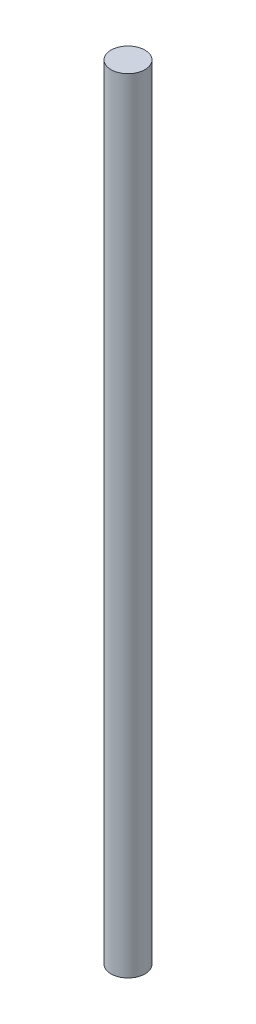
ISO-10303-21;
HEADER;
FILE_DESCRIPTION(('STEP AP214'),'2;1');
FILE_NAME('part.step','',(''),(''),'','','');
FILE_SCHEMA(('AUTOMOTIVE_DESIGN { 1 0 10303 214 1 1 1 1 }'));
ENDSEC;
DATA;
#1=APPLICATION_CONTEXT('core data for automotive mechanical design processes');
#2=APPLICATION_PROTOCOL_DEFINITION('international standard','automotive_design',2000,#1);
#3=PRODUCT_CONTEXT('',#1,'mechanical');
#4=PRODUCT('Part','Part','',(#3));
#5=PRODUCT_RELATED_PRODUCT_CATEGORY('part','',(#4));
#6=PRODUCT_DEFINITION_FORMATION('','',#4);
#7=PRODUCT_DEFINITION_CONTEXT('part definition',#1,'design');
#8=PRODUCT_DEFINITION('design','',#6,#7);
#9=PRODUCT_DEFINITION_SHAPE('','',#8);
#10=(LENGTH_UNIT() NAMED_UNIT(*) SI_UNIT(.MILLI.,.METRE.));
#11=(NAMED_UNIT(*) PLANE_ANGLE_UNIT() SI_UNIT($,.RADIAN.));
#12=(NAMED_UNIT(*) SI_UNIT($,.STERADIAN.) SOLID_ANGLE_UNIT());
#13=UNCERTAINTY_MEASURE_WITH_UNIT(LENGTH_MEASURE(1.E-05),#10,'distance_accuracy_value','');
#14=(GEOMETRIC_REPRESENTATION_CONTEXT(3) GLOBAL_UNCERTAINTY_ASSIGNED_CONTEXT((#13)) GLOBAL_UNIT_ASSIGNED_CONTEXT((#10,
#11,#12)) REPRESENTATION_CONTEXT('',''));
#15=CARTESIAN_POINT('',(0.,0.,0.));
#16=DIRECTION('',(0.,0.,1.));
#17=DIRECTION('',(1.,0.,0.));
#18=AXIS2_PLACEMENT_3D('',#15,#16,#17);
#19=CARTESIAN_POINT('',(0.,84.963,0.));
#20=DIRECTION('',(0.,-1.,0.));
#21=DIRECTION('',(0.,0.,-1.));
#22=AXIS2_PLACEMENT_3D('',#19,#20,#21);
#23=CYLINDRICAL_SURFACE('',#22,1.8415);
#24=CARTESIAN_POINT('',(0.,84.963,0.));
#25=DIRECTION('',(0.,1.,0.));
#26=DIRECTION('',(0.,0.,1.));
#27=AXIS2_PLACEMENT_3D('',#24,#25,#26);
#28=CIRCLE('',#27,1.8415);
#29=CARTESIAN_POINT('',(0.,84.963,1.8415));
#30=VERTEX_POINT('',#29);
#31=EDGE_CURVE('E10',#30,#30,#28,.T.);
#32=ORIENTED_EDGE('',*,*,#31,.F.);
#33=EDGE_LOOP('',(#32));
#34=FACE_BOUND('',#33,.T.);
#35=CARTESIAN_POINT('',(0.,0.,0.));
#36=DIRECTION('',(0.,1.,0.));
#37=DIRECTION('',(0.,0.,1.));
#38=AXIS2_PLACEMENT_3D('',#35,#36,#37);
#39=CIRCLE('',#38,1.8415);
#40=CARTESIAN_POINT('',(0.,0.,1.8415));
#41=VERTEX_POINT('',#40);
#42=EDGE_CURVE('E44',#41,#41,#39,.T.);
#43=ORIENTED_EDGE('',*,*,#42,.T.);
#44=EDGE_LOOP('',(#43));
#45=FACE_BOUND('',#44,.T.);
#46=ADVANCED_FACE('F41',(#34,#45),#23,.T.);
#47=CARTESIAN_POINT('',(0.,84.963,0.));
#48=DIRECTION('',(0.,1.,0.));
#49=DIRECTION('',(0.,0.,1.));
#50=AXIS2_PLACEMENT_3D('',#47,#48,#49);
#51=PLANE('',#50);
#52=ORIENTED_EDGE('',*,*,#31,.T.);
#53=EDGE_LOOP('',(#52));
#54=FACE_BOUND('',#53,.T.);
#55=ADVANCED_FACE('F58',(#54),#51,.T.);
#56=CARTESIAN_POINT('',(0.,0.,0.));
#57=DIRECTION('',(0.,1.,0.));
#58=DIRECTION('',(0.,0.,1.));
#59=AXIS2_PLACEMENT_3D('',#56,#57,#58);
#60=PLANE('',#59);
#61=ORIENTED_EDGE('',*,*,#42,.F.);
#62=EDGE_LOOP('',(#61));
#63=FACE_BOUND('',#62,.T.);
#64=ADVANCED_FACE('F56',(#63),#60,.F.);
#65=CLOSED_SHELL('',(#46,#55,#64));
#66=MANIFOLD_SOLID_BREP('B2',#65);
#67=ADVANCED_BREP_SHAPE_REPRESENTATION('',(#18,#66),#14);
#68=SHAPE_DEFINITION_REPRESENTATION(#9,#67);
ENDSEC;
END-ISO-10303-21;
